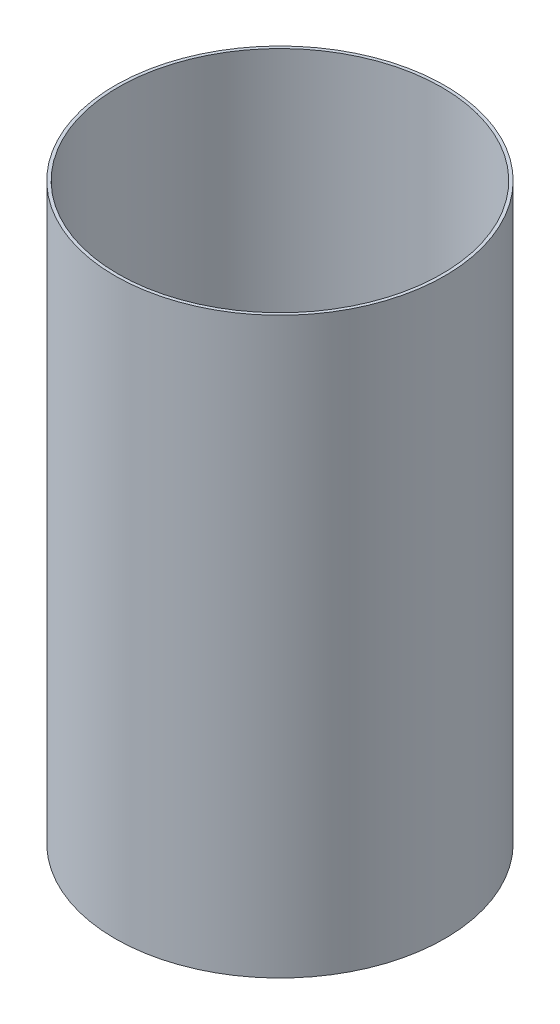
ISO-10303-21;
HEADER;
FILE_DESCRIPTION(('STEP AP214'),'2;1');
FILE_NAME('part.step','',(''),(''),'','','');
FILE_SCHEMA(('AUTOMOTIVE_DESIGN { 1 0 10303 214 1 1 1 1 }'));
ENDSEC;
DATA;
#1=APPLICATION_CONTEXT('core data for automotive mechanical design processes');
#2=APPLICATION_PROTOCOL_DEFINITION('international standard','automotive_design',2000,#1);
#3=PRODUCT_CONTEXT('',#1,'mechanical');
#4=PRODUCT('Part','Part','',(#3));
#5=PRODUCT_RELATED_PRODUCT_CATEGORY('part','',(#4));
#6=PRODUCT_DEFINITION_FORMATION('','',#4);
#7=PRODUCT_DEFINITION_CONTEXT('part definition',#1,'design');
#8=PRODUCT_DEFINITION('design','',#6,#7);
#9=PRODUCT_DEFINITION_SHAPE('','',#8);
#10=(LENGTH_UNIT() NAMED_UNIT(*) SI_UNIT(.MILLI.,.METRE.));
#11=(NAMED_UNIT(*) PLANE_ANGLE_UNIT() SI_UNIT($,.RADIAN.));
#12=(NAMED_UNIT(*) SI_UNIT($,.STERADIAN.) SOLID_ANGLE_UNIT());
#13=UNCERTAINTY_MEASURE_WITH_UNIT(LENGTH_MEASURE(1.E-05),#10,'distance_accuracy_value','');
#14=(GEOMETRIC_REPRESENTATION_CONTEXT(3) GLOBAL_UNCERTAINTY_ASSIGNED_CONTEXT((#13)) GLOBAL_UNIT_ASSIGNED_CONTEXT((#10,
#11,#12)) REPRESENTATION_CONTEXT('',''));
#15=CARTESIAN_POINT('',(0.,0.,0.));
#16=DIRECTION('',(0.,0.,1.));
#17=DIRECTION('',(1.,0.,0.));
#18=AXIS2_PLACEMENT_3D('',#15,#16,#17);
#19=CARTESIAN_POINT('',(0.,115.146666666667,0.));
#20=DIRECTION('',(0.,1.,0.));
#21=DIRECTION('',(0.,0.,1.));
#22=AXIS2_PLACEMENT_3D('',#19,#20,#21);
#23=PLANE('',#22);
#24=CARTESIAN_POINT('',(0.,115.146666666667,0.));
#25=DIRECTION('',(0.,1.,0.));
#26=DIRECTION('',(0.,0.,1.));
#27=AXIS2_PLACEMENT_3D('',#24,#25,#26);
#28=CIRCLE('',#27,33.0835);
#29=CARTESIAN_POINT('',(0.,115.146666666667,33.0835));
#30=VERTEX_POINT('',#29);
#31=EDGE_CURVE('E10',#30,#30,#28,.T.);
#32=ORIENTED_EDGE('',*,*,#31,.T.);
#33=EDGE_LOOP('',(#32));
#34=FACE_BOUND('',#33,.T.);
#35=CARTESIAN_POINT('',(0.,115.146666666667,0.));
#36=DIRECTION('',(0.,1.,0.));
#37=DIRECTION('',(0.,0.,1.));
#38=AXIS2_PLACEMENT_3D('',#35,#36,#37);
#39=CIRCLE('',#38,32.4612);
#40=CARTESIAN_POINT('',(0.,115.146666666667,32.4612));
#41=VERTEX_POINT('',#40);
#42=EDGE_CURVE('E52',#41,#41,#39,.T.);
#43=ORIENTED_EDGE('',*,*,#42,.F.);
#44=EDGE_LOOP('',(#43));
#45=FACE_BOUND('',#44,.T.);
#46=ADVANCED_FACE('F41',(#34,#45),#23,.T.);
#47=CARTESIAN_POINT('',(0.,0.,0.));
#48=DIRECTION('',(0.,1.,0.));
#49=DIRECTION('',(0.,0.,1.));
#50=AXIS2_PLACEMENT_3D('',#47,#48,#49);
#51=PLANE('',#50);
#52=CARTESIAN_POINT('',(0.,0.,0.));
#53=DIRECTION('',(0.,1.,0.));
#54=DIRECTION('',(0.,0.,1.));
#55=AXIS2_PLACEMENT_3D('',#52,#53,#54);
#56=CIRCLE('',#55,33.0835);
#57=CARTESIAN_POINT('',(0.,0.,33.0835));
#58=VERTEX_POINT('',#57);
#59=EDGE_CURVE('E45',#58,#58,#56,.T.);
#60=ORIENTED_EDGE('',*,*,#59,.F.);
#61=EDGE_LOOP('',(#60));
#62=FACE_BOUND('',#61,.T.);
#63=CARTESIAN_POINT('',(0.,0.,0.));
#64=DIRECTION('',(0.,1.,0.));
#65=DIRECTION('',(0.,0.,1.));
#66=AXIS2_PLACEMENT_3D('',#63,#64,#65);
#67=CIRCLE('',#66,32.4612);
#68=CARTESIAN_POINT('',(0.,0.,32.4612));
#69=VERTEX_POINT('',#68);
#70=EDGE_CURVE('E54',#69,#69,#67,.T.);
#71=ORIENTED_EDGE('',*,*,#70,.T.);
#72=EDGE_LOOP('',(#71));
#73=FACE_BOUND('',#72,.T.);
#74=ADVANCED_FACE('F64',(#62,#73),#51,.F.);
#75=CARTESIAN_POINT('',(0.,115.146666666667,0.));
#76=DIRECTION('',(0.,-1.,0.));
#77=DIRECTION('',(0.,0.,-1.));
#78=AXIS2_PLACEMENT_3D('',#75,#76,#77);
#79=CYLINDRICAL_SURFACE('',#78,33.0835);
#80=ORIENTED_EDGE('',*,*,#31,.F.);
#81=EDGE_LOOP('',(#80));
#82=FACE_BOUND('',#81,.T.);
#83=ORIENTED_EDGE('',*,*,#59,.T.);
#84=EDGE_LOOP('',(#83));
#85=FACE_BOUND('',#84,.T.);
#86=ADVANCED_FACE('F43',(#82,#85),#79,.T.);
#87=CARTESIAN_POINT('',(0.,115.146666666667,0.));
#88=DIRECTION('',(0.,-1.,0.));
#89=DIRECTION('',(0.,0.,-1.));
#90=AXIS2_PLACEMENT_3D('',#87,#88,#89);
#91=CYLINDRICAL_SURFACE('',#90,32.4612);
#92=ORIENTED_EDGE('',*,*,#42,.T.);
#93=EDGE_LOOP('',(#92));
#94=FACE_BOUND('',#93,.T.);
#95=ORIENTED_EDGE('',*,*,#70,.F.);
#96=EDGE_LOOP('',(#95));
#97=FACE_BOUND('',#96,.T.);
#98=ADVANCED_FACE('F60',(#94,#97),#91,.F.);
#99=CLOSED_SHELL('',(#46,#74,#86,#98));
#100=MANIFOLD_SOLID_BREP('B2',#99);
#101=ADVANCED_BREP_SHAPE_REPRESENTATION('',(#18,#100),#14);
#102=SHAPE_DEFINITION_REPRESENTATION(#9,#101);
ENDSEC;
END-ISO-10303-21;
